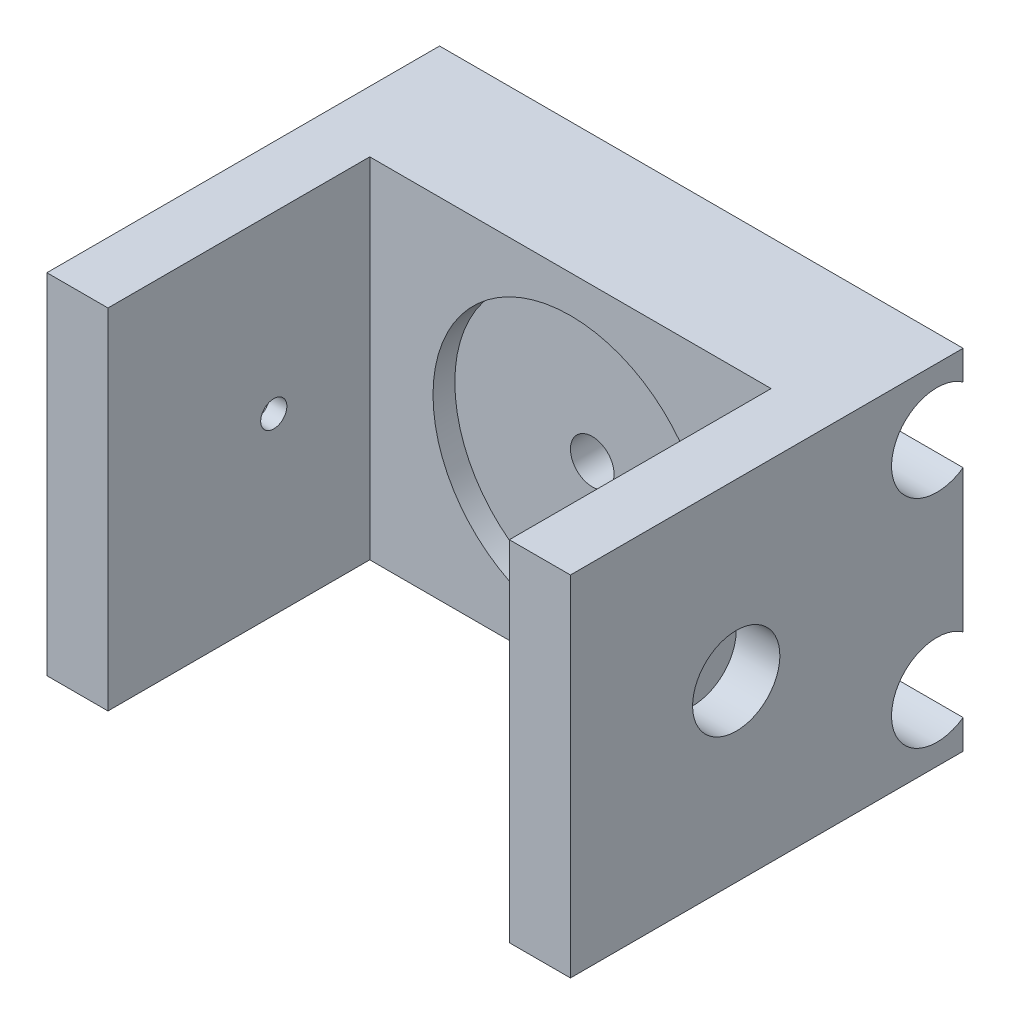
ISO-10303-21;
HEADER;
FILE_DESCRIPTION(('STEP AP214'),'2;1');
FILE_NAME('part.step','',(''),(''),'','','');
FILE_SCHEMA(('AUTOMOTIVE_DESIGN { 1 0 10303 214 1 1 1 1 }'));
ENDSEC;
DATA;
#1=APPLICATION_CONTEXT('core data for automotive mechanical design processes');
#2=APPLICATION_PROTOCOL_DEFINITION('international standard','automotive_design',2000,#1);
#3=PRODUCT_CONTEXT('',#1,'mechanical');
#4=PRODUCT('Part','Part','',(#3));
#5=PRODUCT_RELATED_PRODUCT_CATEGORY('part','',(#4));
#6=PRODUCT_DEFINITION_FORMATION('','',#4);
#7=PRODUCT_DEFINITION_CONTEXT('part definition',#1,'design');
#8=PRODUCT_DEFINITION('design','',#6,#7);
#9=PRODUCT_DEFINITION_SHAPE('','',#8);
#10=(LENGTH_UNIT() NAMED_UNIT(*) SI_UNIT(.MILLI.,.METRE.));
#11=(NAMED_UNIT(*) PLANE_ANGLE_UNIT() SI_UNIT($,.RADIAN.));
#12=(NAMED_UNIT(*) SI_UNIT($,.STERADIAN.) SOLID_ANGLE_UNIT());
#13=UNCERTAINTY_MEASURE_WITH_UNIT(LENGTH_MEASURE(1.E-05),#10,'distance_accuracy_value','');
#14=(GEOMETRIC_REPRESENTATION_CONTEXT(3) GLOBAL_UNCERTAINTY_ASSIGNED_CONTEXT((#13)) GLOBAL_UNIT_ASSIGNED_CONTEXT((#10,
#11,#12)) REPRESENTATION_CONTEXT('',''));
#15=CARTESIAN_POINT('',(0.,0.,0.));
#16=DIRECTION('',(0.,0.,1.));
#17=DIRECTION('',(1.,0.,0.));
#18=AXIS2_PLACEMENT_3D('',#15,#16,#17);
#19=CARTESIAN_POINT('',(12.2222222222222,0.915032679738576,45.));
#20=DIRECTION('',(0.,0.,-1.));
#21=DIRECTION('',(-1.,0.,0.));
#22=AXIS2_PLACEMENT_3D('',#19,#20,#21);
#23=CYLINDRICAL_SURFACE('',#22,2.5);
#24=CARTESIAN_POINT('',(12.2222222222222,0.915032679738576,4.));
#25=DIRECTION('',(0.,0.,-1.));
#26=DIRECTION('',(-1.,0.,0.));
#27=AXIS2_PLACEMENT_3D('',#24,#25,#26);
#28=CIRCLE('',#27,2.5);
#29=CARTESIAN_POINT('',(9.72222222222224,0.915032679738576,4.));
#30=VERTEX_POINT('',#29);
#31=EDGE_CURVE('E242',#30,#30,#28,.T.);
#32=ORIENTED_EDGE('',*,*,#31,.T.);
#33=EDGE_LOOP('',(#32));
#34=FACE_BOUND('',#33,.T.);
#35=CARTESIAN_POINT('',(12.2222222222222,0.915032679738576,12.5));
#36=DIRECTION('',(0.,0.,1.));
#37=DIRECTION('',(1.,0.,0.));
#38=AXIS2_PLACEMENT_3D('',#35,#36,#37);
#39=CIRCLE('',#38,2.5);
#40=CARTESIAN_POINT('',(14.7222222222222,0.915032679738576,12.5));
#41=VERTEX_POINT('',#40);
#42=EDGE_CURVE('E240',#41,#41,#39,.F.);
#43=ORIENTED_EDGE('',*,*,#42,.F.);
#44=EDGE_LOOP('',(#43));
#45=FACE_BOUND('',#44,.T.);
#46=ADVANCED_FACE('F49',(#34,#45),#23,.F.);
#47=CARTESIAN_POINT('',(0.,0.,0.));
#48=DIRECTION('',(0.,0.,1.));
#49=DIRECTION('',(1.,0.,0.));
#50=AXIS2_PLACEMENT_3D('',#47,#48,#49);
#51=PLANE('',#50);
#52=DIRECTION('',(0.,-1.,0.));
#53=VECTOR('',#52,1.);
#54=CARTESIAN_POINT('',(-17.7777777777778,20.9150326797386,0.));
#55=LINE('',#54,#53);
#56=CARTESIAN_POINT('',(-17.7777777777778,-15.7323194365805,0.));
#57=VERTEX_POINT('',#56);
#58=CARTESIAN_POINT('',(-17.7777777777778,-19.0849673202614,0.));
#59=VERTEX_POINT('',#58);
#60=EDGE_CURVE('E147',#57,#59,#55,.T.);
#61=ORIENTED_EDGE('',*,*,#60,.F.);
#62=DIRECTION('',(1.,0.,0.));
#63=VECTOR('',#62,1.);
#64=CARTESIAN_POINT('',(-20.7777777777778,-15.7323194365805,0.));
#65=LINE('',#64,#63);
#66=CARTESIAN_POINT('',(42.2222222222222,-15.7323194365805,0.));
#67=VERTEX_POINT('',#66);
#68=EDGE_CURVE('E11',#57,#67,#65,.T.);
#69=ORIENTED_EDGE('',*,*,#68,.T.);
#70=DIRECTION('',(0.,1.,0.));
#71=VECTOR('',#70,1.);
#72=CARTESIAN_POINT('',(42.2222222222222,20.9150326797386,0.));
#73=LINE('',#72,#71);
#74=CARTESIAN_POINT('',(42.2222222222222,-19.0849673202614,0.));
#75=VERTEX_POINT('',#74);
#76=EDGE_CURVE('E223',#75,#67,#73,.T.);
#77=ORIENTED_EDGE('',*,*,#76,.F.);
#78=DIRECTION('',(1.,0.,0.));
#79=VECTOR('',#78,1.);
#80=CARTESIAN_POINT('',(-17.7777777777778,-19.0849673202614,0.));
#81=LINE('',#80,#79);
#82=EDGE_CURVE('E219',#59,#75,#81,.T.);
#83=ORIENTED_EDGE('',*,*,#82,.F.);
#84=EDGE_LOOP('',(#61,#69,#77,#83));
#85=FACE_BOUND('',#84,.T.);
#86=ADVANCED_FACE('F287',(#85),#51,.F.);
#87=CARTESIAN_POINT('',(12.2222222222222,0.915032679738576,0.));
#88=DIRECTION('',(0.,0.,-1.));
#89=DIRECTION('',(-1.,0.,0.));
#90=AXIS2_PLACEMENT_3D('',#87,#88,#89);
#91=CIRCLE('',#90,5.);
#92=CARTESIAN_POINT('',(7.22222222222224,0.915032679738576,0.));
#93=VERTEX_POINT('',#92);
#94=EDGE_CURVE('E247',#93,#93,#91,.T.);
#95=ORIENTED_EDGE('',*,*,#94,.F.);
#96=EDGE_LOOP('',(#95));
#97=FACE_BOUND('',#96,.T.);
#98=CARTESIAN_POINT('',(42.2222222222222,-7.23761520394236,0.));
#99=VERTEX_POINT('',#98);
#100=CARTESIAN_POINT('',(42.2222222222222,9.06768056341952,0.));
#101=VERTEX_POINT('',#100);
#102=EDGE_CURVE('E226',#99,#101,#73,.T.);
#103=ORIENTED_EDGE('',*,*,#102,.F.);
#104=DIRECTION('',(1.,0.,0.));
#105=VECTOR('',#104,1.);
#106=CARTESIAN_POINT('',(-20.7777777777778,-7.23761520394237,0.));
#107=LINE('',#106,#105);
#108=CARTESIAN_POINT('',(-17.7777777777778,-7.23761520394236,0.));
#109=VERTEX_POINT('',#108);
#110=EDGE_CURVE('E58',#99,#109,#107,.F.);
#111=ORIENTED_EDGE('',*,*,#110,.T.);
#112=CARTESIAN_POINT('',(-17.7777777777778,9.06768056341951,0.));
#113=VERTEX_POINT('',#112);
#114=EDGE_CURVE('E220',#113,#109,#55,.T.);
#115=ORIENTED_EDGE('',*,*,#114,.F.);
#116=DIRECTION('',(1.,0.,0.));
#117=VECTOR('',#116,1.);
#118=CARTESIAN_POINT('',(-20.7777777777778,9.06768056341951,0.));
#119=LINE('',#118,#117);
#120=EDGE_CURVE('E236',#113,#101,#119,.T.);
#121=ORIENTED_EDGE('',*,*,#120,.T.);
#122=EDGE_LOOP('',(#103,#111,#115,#121));
#123=FACE_BOUND('',#122,.T.);
#124=ADVANCED_FACE('F295',(#97,#123),#51,.F.);
#125=CARTESIAN_POINT('',(-17.7777777777778,20.9150326797386,15.));
#126=DIRECTION('',(1.,0.,0.));
#127=DIRECTION('',(0.,0.,-1.));
#128=AXIS2_PLACEMENT_3D('',#125,#126,#127);
#129=PLANE('',#128);
#130=CARTESIAN_POINT('',(-17.7777777777778,0.915032679738565,26.));
#131=DIRECTION('',(1.,0.,0.));
#132=DIRECTION('',(0.,1.,0.));
#133=AXIS2_PLACEMENT_3D('',#130,#131,#132);
#134=CIRCLE('',#133,5.);
#135=CARTESIAN_POINT('',(-17.7777777777778,5.91503267973857,26.));
#136=VERTEX_POINT('',#135);
#137=EDGE_CURVE('E263',#136,#136,#134,.T.);
#138=ORIENTED_EDGE('',*,*,#137,.T.);
#139=EDGE_LOOP('',(#138));
#140=FACE_BOUND('',#139,.T.);
#141=ORIENTED_EDGE('',*,*,#114,.T.);
#142=CARTESIAN_POINT('',(-17.7777777777778,-11.4849673202614,3.));
#143=DIRECTION('',(1.,0.,0.));
#144=DIRECTION('',(0.,0.,-1.));
#145=AXIS2_PLACEMENT_3D('',#142,#143,#144);
#146=CIRCLE('',#145,5.2);
#147=EDGE_CURVE('E209',#109,#57,#146,.T.);
#148=ORIENTED_EDGE('',*,*,#147,.T.);
#149=ORIENTED_EDGE('',*,*,#60,.T.);
#150=DIRECTION('',(0.,0.,-1.));
#151=VECTOR('',#150,1.);
#152=CARTESIAN_POINT('',(-17.7777777777778,-19.0849673202614,15.));
#153=LINE('',#152,#151);
#154=CARTESIAN_POINT('',(-17.7777777777778,-19.0849673202614,45.));
#155=VERTEX_POINT('',#154);
#156=EDGE_CURVE('E139',#155,#59,#153,.T.);
#157=ORIENTED_EDGE('',*,*,#156,.F.);
#158=DIRECTION('',(0.,1.,0.));
#159=VECTOR('',#158,1.);
#160=CARTESIAN_POINT('',(-17.7777777777778,20.9150326797386,45.));
#161=LINE('',#160,#159);
#162=CARTESIAN_POINT('',(-17.7777777777778,20.9150326797386,45.));
#163=VERTEX_POINT('',#162);
#164=EDGE_CURVE('E143',#155,#163,#161,.T.);
#165=ORIENTED_EDGE('',*,*,#164,.T.);
#166=DIRECTION('',(0.,0.,-1.));
#167=VECTOR('',#166,1.);
#168=CARTESIAN_POINT('',(-17.7777777777778,20.9150326797386,15.));
#169=LINE('',#168,#167);
#170=CARTESIAN_POINT('',(-17.7777777777778,20.9150326797386,0.));
#171=VERTEX_POINT('',#170);
#172=EDGE_CURVE('E215',#163,#171,#169,.T.);
#173=ORIENTED_EDGE('',*,*,#172,.T.);
#174=CARTESIAN_POINT('',(-17.7777777777778,17.5623847960576,0.));
#175=VERTEX_POINT('',#174);
#176=EDGE_CURVE('E216',#171,#175,#55,.T.);
#177=ORIENTED_EDGE('',*,*,#176,.T.);
#178=CARTESIAN_POINT('',(-17.7777777777778,13.3150326797386,3.));
#179=DIRECTION('',(1.,0.,0.));
#180=DIRECTION('',(0.,0.,-1.));
#181=AXIS2_PLACEMENT_3D('',#178,#179,#180);
#182=CIRCLE('',#181,5.2);
#183=EDGE_CURVE('E205',#175,#113,#182,.T.);
#184=ORIENTED_EDGE('',*,*,#183,.T.);
#185=EDGE_LOOP('',(#141,#148,#149,#157,#165,#173,#177,#184));
#186=FACE_BOUND('',#185,.T.);
#187=ADVANCED_FACE('F51',(#140,#186),#129,.F.);
#188=CARTESIAN_POINT('',(-17.7777777777778,-19.0849673202614,15.));
#189=DIRECTION('',(0.,1.,0.));
#190=DIRECTION('',(-1.,0.,0.));
#191=AXIS2_PLACEMENT_3D('',#188,#189,#190);
#192=PLANE('',#191);
#193=ORIENTED_EDGE('',*,*,#82,.T.);
#194=DIRECTION('',(0.,0.,-1.));
#195=VECTOR('',#194,1.);
#196=CARTESIAN_POINT('',(42.2222222222222,-19.0849673202614,15.));
#197=LINE('',#196,#195);
#198=CARTESIAN_POINT('',(42.2222222222222,-19.0849673202614,45.));
#199=VERTEX_POINT('',#198);
#200=EDGE_CURVE('E152',#199,#75,#197,.T.);
#201=ORIENTED_EDGE('',*,*,#200,.F.);
#202=DIRECTION('',(1.,0.,0.));
#203=VECTOR('',#202,1.);
#204=CARTESIAN_POINT('',(42.2222222222222,-19.0849673202614,45.));
#205=LINE('',#204,#203);
#206=CARTESIAN_POINT('',(35.2222222222222,-19.0849673202614,45.));
#207=VERTEX_POINT('',#206);
#208=EDGE_CURVE('E191',#207,#199,#205,.T.);
#209=ORIENTED_EDGE('',*,*,#208,.F.);
#210=DIRECTION('',(0.,0.,-1.));
#211=VECTOR('',#210,1.);
#212=CARTESIAN_POINT('',(35.2222222222222,-19.0849673202614,45.));
#213=LINE('',#212,#211);
#214=CARTESIAN_POINT('',(35.2222222222222,-19.0849673202614,15.));
#215=VERTEX_POINT('',#214);
#216=EDGE_CURVE('E194',#207,#215,#213,.T.);
#217=ORIENTED_EDGE('',*,*,#216,.T.);
#218=DIRECTION('',(1.,0.,0.));
#219=VECTOR('',#218,1.);
#220=CARTESIAN_POINT('',(-17.7777777777778,-19.0849673202614,15.));
#221=LINE('',#220,#219);
#222=CARTESIAN_POINT('',(-10.7777777777778,-19.0849673202614,15.));
#223=VERTEX_POINT('',#222);
#224=EDGE_CURVE('E211',#223,#215,#221,.T.);
#225=ORIENTED_EDGE('',*,*,#224,.F.);
#226=DIRECTION('',(0.,0.,-1.));
#227=VECTOR('',#226,1.);
#228=CARTESIAN_POINT('',(-10.7777777777778,-19.0849673202614,45.));
#229=LINE('',#228,#227);
#230=CARTESIAN_POINT('',(-10.7777777777778,-19.0849673202614,45.));
#231=VERTEX_POINT('',#230);
#232=EDGE_CURVE('E165',#231,#223,#229,.T.);
#233=ORIENTED_EDGE('',*,*,#232,.F.);
#234=DIRECTION('',(-1.,0.,0.));
#235=VECTOR('',#234,1.);
#236=CARTESIAN_POINT('',(-17.7777777777778,-19.0849673202614,45.));
#237=LINE('',#236,#235);
#238=EDGE_CURVE('E158',#231,#155,#237,.T.);
#239=ORIENTED_EDGE('',*,*,#238,.T.);
#240=ORIENTED_EDGE('',*,*,#156,.T.);
#241=EDGE_LOOP('',(#193,#201,#209,#217,#225,#233,#239,#240));
#242=FACE_BOUND('',#241,.T.);
#243=ADVANCED_FACE('F163',(#242),#192,.F.);
#244=CARTESIAN_POINT('',(42.2222222222222,20.9150326797386,15.));
#245=DIRECTION('',(-1.,0.,0.));
#246=DIRECTION('',(0.,-1.,0.));
#247=AXIS2_PLACEMENT_3D('',#244,#245,#246);
#248=PLANE('',#247);
#249=CARTESIAN_POINT('',(42.2222222222222,0.915032679738576,26.));
#250=DIRECTION('',(1.,0.,0.));
#251=DIRECTION('',(0.,1.,0.));
#252=AXIS2_PLACEMENT_3D('',#249,#250,#251);
#253=CIRCLE('',#252,5.);
#254=CARTESIAN_POINT('',(42.2222222222222,5.91503267973858,26.));
#255=VERTEX_POINT('',#254);
#256=EDGE_CURVE('E177',#255,#255,#253,.T.);
#257=ORIENTED_EDGE('',*,*,#256,.F.);
#258=EDGE_LOOP('',(#257));
#259=FACE_BOUND('',#258,.T.);
#260=ORIENTED_EDGE('',*,*,#76,.T.);
#261=CARTESIAN_POINT('',(42.2222222222222,-11.4849673202614,3.));
#262=DIRECTION('',(1.,0.,0.));
#263=DIRECTION('',(0.,1.,0.));
#264=AXIS2_PLACEMENT_3D('',#261,#262,#263);
#265=CIRCLE('',#264,5.2);
#266=EDGE_CURVE('E203',#99,#67,#265,.T.);
#267=ORIENTED_EDGE('',*,*,#266,.F.);
#268=ORIENTED_EDGE('',*,*,#102,.T.);
#269=CARTESIAN_POINT('',(42.2222222222222,13.3150326797386,3.));
#270=DIRECTION('',(1.,0.,0.));
#271=DIRECTION('',(0.,1.,0.));
#272=AXIS2_PLACEMENT_3D('',#269,#270,#271);
#273=CIRCLE('',#272,5.2);
#274=CARTESIAN_POINT('',(42.2222222222222,17.5623847960576,0.));
#275=VERTEX_POINT('',#274);
#276=EDGE_CURVE('E202',#275,#101,#273,.T.);
#277=ORIENTED_EDGE('',*,*,#276,.F.);
#278=CARTESIAN_POINT('',(42.2222222222222,20.9150326797386,0.));
#279=VERTEX_POINT('',#278);
#280=EDGE_CURVE('E222',#275,#279,#73,.T.);
#281=ORIENTED_EDGE('',*,*,#280,.T.);
#282=DIRECTION('',(0.,0.,-1.));
#283=VECTOR('',#282,1.);
#284=CARTESIAN_POINT('',(42.2222222222222,20.9150326797386,15.));
#285=LINE('',#284,#283);
#286=CARTESIAN_POINT('',(42.2222222222222,20.9150326797386,45.));
#287=VERTEX_POINT('',#286);
#288=EDGE_CURVE('E229',#287,#279,#285,.T.);
#289=ORIENTED_EDGE('',*,*,#288,.F.);
#290=DIRECTION('',(0.,1.,0.));
#291=VECTOR('',#290,1.);
#292=CARTESIAN_POINT('',(42.2222222222222,20.9150326797386,45.));
#293=LINE('',#292,#291);
#294=EDGE_CURVE('E184',#199,#287,#293,.T.);
#295=ORIENTED_EDGE('',*,*,#294,.F.);
#296=ORIENTED_EDGE('',*,*,#200,.T.);
#297=EDGE_LOOP('',(#260,#267,#268,#277,#281,#289,#295,#296));
#298=FACE_BOUND('',#297,.T.);
#299=ADVANCED_FACE('F324',(#259,#298),#248,.F.);
#300=CARTESIAN_POINT('',(-17.7777777777778,20.9150326797386,15.));
#301=DIRECTION('',(0.,-1.,0.));
#302=DIRECTION('',(0.,0.,-1.));
#303=AXIS2_PLACEMENT_3D('',#300,#301,#302);
#304=PLANE('',#303);
#305=DIRECTION('',(-1.,0.,0.));
#306=VECTOR('',#305,1.);
#307=CARTESIAN_POINT('',(-17.7777777777778,20.9150326797386,0.));
#308=LINE('',#307,#306);
#309=EDGE_CURVE('E213',#279,#171,#308,.T.);
#310=ORIENTED_EDGE('',*,*,#309,.T.);
#311=ORIENTED_EDGE('',*,*,#172,.F.);
#312=DIRECTION('',(1.,0.,0.));
#313=VECTOR('',#312,1.);
#314=CARTESIAN_POINT('',(-17.7777777777778,20.9150326797386,45.));
#315=LINE('',#314,#313);
#316=CARTESIAN_POINT('',(-10.7777777777778,20.9150326797386,45.));
#317=VERTEX_POINT('',#316);
#318=EDGE_CURVE('E161',#163,#317,#315,.T.);
#319=ORIENTED_EDGE('',*,*,#318,.T.);
#320=DIRECTION('',(0.,0.,-1.));
#321=VECTOR('',#320,1.);
#322=CARTESIAN_POINT('',(-10.7777777777778,20.9150326797386,45.));
#323=LINE('',#322,#321);
#324=CARTESIAN_POINT('',(-10.7777777777778,20.9150326797386,15.));
#325=VERTEX_POINT('',#324);
#326=EDGE_CURVE('E172',#317,#325,#323,.T.);
#327=ORIENTED_EDGE('',*,*,#326,.T.);
#328=DIRECTION('',(-1.,0.,0.));
#329=VECTOR('',#328,1.);
#330=CARTESIAN_POINT('',(-17.7777777777778,20.9150326797386,15.));
#331=LINE('',#330,#329);
#332=CARTESIAN_POINT('',(35.2222222222222,20.9150326797386,15.));
#333=VERTEX_POINT('',#332);
#334=EDGE_CURVE('E71',#333,#325,#331,.T.);
#335=ORIENTED_EDGE('',*,*,#334,.F.);
#336=DIRECTION('',(0.,0.,-1.));
#337=VECTOR('',#336,1.);
#338=CARTESIAN_POINT('',(35.2222222222222,20.9150326797386,45.));
#339=LINE('',#338,#337);
#340=CARTESIAN_POINT('',(35.2222222222222,20.9150326797386,45.));
#341=VERTEX_POINT('',#340);
#342=EDGE_CURVE('E199',#341,#333,#339,.T.);
#343=ORIENTED_EDGE('',*,*,#342,.F.);
#344=DIRECTION('',(-1.,0.,0.));
#345=VECTOR('',#344,1.);
#346=CARTESIAN_POINT('',(42.2222222222222,20.9150326797386,45.));
#347=LINE('',#346,#345);
#348=EDGE_CURVE('E187',#287,#341,#347,.T.);
#349=ORIENTED_EDGE('',*,*,#348,.F.);
#350=ORIENTED_EDGE('',*,*,#288,.T.);
#351=EDGE_LOOP('',(#310,#311,#319,#327,#335,#343,#349,#350));
#352=FACE_BOUND('',#351,.T.);
#353=ADVANCED_FACE('F330',(#352),#304,.F.);
#354=CARTESIAN_POINT('',(0.,0.,15.));
#355=DIRECTION('',(0.,0.,1.));
#356=DIRECTION('',(1.,0.,0.));
#357=AXIS2_PLACEMENT_3D('',#354,#355,#356);
#358=PLANE('',#357);
#359=CARTESIAN_POINT('',(12.2222222222222,0.915032679738576,15.));
#360=DIRECTION('',(0.,0.,1.));
#361=DIRECTION('',(1.,0.,0.));
#362=AXIS2_PLACEMENT_3D('',#359,#360,#361);
#363=CIRCLE('',#362,15.75);
#364=CARTESIAN_POINT('',(27.9722222222222,0.915032679738576,15.));
#365=VERTEX_POINT('',#364);
#366=EDGE_CURVE('E250',#365,#365,#363,.T.);
#367=ORIENTED_EDGE('',*,*,#366,.F.);
#368=EDGE_LOOP('',(#367));
#369=FACE_BOUND('',#368,.T.);
#370=DIRECTION('',(0.,-1.,0.));
#371=VECTOR('',#370,1.);
#372=CARTESIAN_POINT('',(-10.7777777777778,20.9150326797386,15.));
#373=LINE('',#372,#371);
#374=EDGE_CURVE('E66',#325,#223,#373,.T.);
#375=ORIENTED_EDGE('',*,*,#374,.T.);
#376=ORIENTED_EDGE('',*,*,#224,.T.);
#377=DIRECTION('',(0.,-1.,0.));
#378=VECTOR('',#377,1.);
#379=CARTESIAN_POINT('',(35.2222222222222,20.9150326797386,15.));
#380=LINE('',#379,#378);
#381=EDGE_CURVE('E181',#333,#215,#380,.T.);
#382=ORIENTED_EDGE('',*,*,#381,.F.);
#383=ORIENTED_EDGE('',*,*,#334,.T.);
#384=EDGE_LOOP('',(#375,#376,#382,#383));
#385=FACE_BOUND('',#384,.T.);
#386=ADVANCED_FACE('F365',(#369,#385),#358,.T.);
#387=ORIENTED_EDGE('',*,*,#280,.F.);
#388=DIRECTION('',(1.,0.,0.));
#389=VECTOR('',#388,1.);
#390=CARTESIAN_POINT('',(-20.7777777777778,17.5623847960576,0.));
#391=LINE('',#390,#389);
#392=EDGE_CURVE('E151',#275,#175,#391,.F.);
#393=ORIENTED_EDGE('',*,*,#392,.T.);
#394=ORIENTED_EDGE('',*,*,#176,.F.);
#395=ORIENTED_EDGE('',*,*,#309,.F.);
#396=EDGE_LOOP('',(#387,#393,#394,#395));
#397=FACE_BOUND('',#396,.T.);
#398=ADVANCED_FACE('F298',(#397),#51,.F.);
#399=CARTESIAN_POINT('',(-20.7777777777778,13.3150326797386,3.));
#400=DIRECTION('',(1.,0.,0.));
#401=DIRECTION('',(0.,1.,0.));
#402=AXIS2_PLACEMENT_3D('',#399,#400,#401);
#403=CYLINDRICAL_SURFACE('',#402,5.2);
#404=ORIENTED_EDGE('',*,*,#183,.F.);
#405=ORIENTED_EDGE('',*,*,#392,.F.);
#406=ORIENTED_EDGE('',*,*,#276,.T.);
#407=ORIENTED_EDGE('',*,*,#120,.F.);
#408=EDGE_LOOP('',(#404,#405,#406,#407));
#409=FACE_BOUND('',#408,.T.);
#410=ADVANCED_FACE('F360',(#409),#403,.F.);
#411=CARTESIAN_POINT('',(-20.7777777777778,-11.4849673202614,3.));
#412=DIRECTION('',(1.,0.,0.));
#413=DIRECTION('',(0.,1.,0.));
#414=AXIS2_PLACEMENT_3D('',#411,#412,#413);
#415=CYLINDRICAL_SURFACE('',#414,5.2);
#416=ORIENTED_EDGE('',*,*,#147,.F.);
#417=ORIENTED_EDGE('',*,*,#110,.F.);
#418=ORIENTED_EDGE('',*,*,#266,.T.);
#419=ORIENTED_EDGE('',*,*,#68,.F.);
#420=EDGE_LOOP('',(#416,#417,#418,#419));
#421=FACE_BOUND('',#420,.T.);
#422=ADVANCED_FACE('F356',(#421),#415,.F.);
#423=CARTESIAN_POINT('',(35.2222222222222,20.9150326797386,45.));
#424=DIRECTION('',(1.,0.,0.));
#425=DIRECTION('',(0.,1.,0.));
#426=AXIS2_PLACEMENT_3D('',#423,#424,#425);
#427=PLANE('',#426);
#428=CARTESIAN_POINT('',(35.2222222222222,0.915032679738574,26.));
#429=DIRECTION('',(1.,0.,0.));
#430=DIRECTION('',(0.,1.,0.));
#431=AXIS2_PLACEMENT_3D('',#428,#429,#430);
#432=CIRCLE('',#431,1.5);
#433=CARTESIAN_POINT('',(35.2222222222222,2.41503267973858,26.));
#434=VERTEX_POINT('',#433);
#435=EDGE_CURVE('E255',#434,#434,#432,.T.);
#436=ORIENTED_EDGE('',*,*,#435,.T.);
#437=EDGE_LOOP('',(#436));
#438=FACE_BOUND('',#437,.T.);
#439=ORIENTED_EDGE('',*,*,#381,.T.);
#440=ORIENTED_EDGE('',*,*,#216,.F.);
#441=DIRECTION('',(0.,-1.,0.));
#442=VECTOR('',#441,1.);
#443=CARTESIAN_POINT('',(35.2222222222222,20.9150326797386,45.));
#444=LINE('',#443,#442);
#445=EDGE_CURVE('E189',#341,#207,#444,.T.);
#446=ORIENTED_EDGE('',*,*,#445,.F.);
#447=ORIENTED_EDGE('',*,*,#342,.T.);
#448=EDGE_LOOP('',(#439,#440,#446,#447));
#449=FACE_BOUND('',#448,.T.);
#450=ADVANCED_FACE('F352',(#438,#449),#427,.F.);
#451=CARTESIAN_POINT('',(0.,0.,45.));
#452=DIRECTION('',(0.,0.,-1.));
#453=DIRECTION('',(-1.,0.,0.));
#454=AXIS2_PLACEMENT_3D('',#451,#452,#453);
#455=PLANE('',#454);
#456=ORIENTED_EDGE('',*,*,#294,.T.);
#457=ORIENTED_EDGE('',*,*,#348,.T.);
#458=ORIENTED_EDGE('',*,*,#445,.T.);
#459=ORIENTED_EDGE('',*,*,#208,.T.);
#460=EDGE_LOOP('',(#456,#457,#458,#459));
#461=FACE_BOUND('',#460,.T.);
#462=ADVANCED_FACE('F348',(#461),#455,.F.);
#463=CARTESIAN_POINT('',(37.2222222222222,0.915032679738575,26.));
#464=DIRECTION('',(1.,0.,0.));
#465=DIRECTION('',(0.,1.,0.));
#466=AXIS2_PLACEMENT_3D('',#463,#464,#465);
#467=CYLINDRICAL_SURFACE('',#466,5.);
#468=CARTESIAN_POINT('',(37.2222222222222,0.915032679738575,26.));
#469=DIRECTION('',(1.,0.,0.));
#470=DIRECTION('',(0.,1.,0.));
#471=AXIS2_PLACEMENT_3D('',#468,#469,#470);
#472=CIRCLE('',#471,5.);
#473=CARTESIAN_POINT('',(37.2222222222222,5.91503267973857,26.));
#474=VERTEX_POINT('',#473);
#475=EDGE_CURVE('E178',#474,#474,#472,.T.);
#476=ORIENTED_EDGE('',*,*,#475,.F.);
#477=EDGE_LOOP('',(#476));
#478=FACE_BOUND('',#477,.T.);
#479=ORIENTED_EDGE('',*,*,#256,.T.);
#480=EDGE_LOOP('',(#479));
#481=FACE_BOUND('',#480,.T.);
#482=ADVANCED_FACE('F341',(#478,#481),#467,.F.);
#483=CARTESIAN_POINT('',(37.2222222222222,0.915032679738575,26.));
#484=DIRECTION('',(1.,0.,0.));
#485=DIRECTION('',(0.,1.,0.));
#486=AXIS2_PLACEMENT_3D('',#483,#484,#485);
#487=PLANE('',#486);
#488=CARTESIAN_POINT('',(37.2222222222222,0.915032679738575,26.));
#489=DIRECTION('',(1.,0.,0.));
#490=DIRECTION('',(0.,1.,0.));
#491=AXIS2_PLACEMENT_3D('',#488,#489,#490);
#492=CIRCLE('',#491,1.5);
#493=CARTESIAN_POINT('',(37.2222222222222,2.41503267973858,26.));
#494=VERTEX_POINT('',#493);
#495=EDGE_CURVE('E534',#494,#494,#492,.T.);
#496=ORIENTED_EDGE('',*,*,#495,.F.);
#497=EDGE_LOOP('',(#496));
#498=FACE_BOUND('',#497,.T.);
#499=ORIENTED_EDGE('',*,*,#475,.T.);
#500=EDGE_LOOP('',(#499));
#501=FACE_BOUND('',#500,.T.);
#502=ADVANCED_FACE('F335',(#498,#501),#487,.T.);
#503=CARTESIAN_POINT('',(-10.7777777777778,20.9150326797386,45.));
#504=DIRECTION('',(1.,0.,0.));
#505=DIRECTION('',(0.,1.,0.));
#506=AXIS2_PLACEMENT_3D('',#503,#504,#505);
#507=PLANE('',#506);
#508=CARTESIAN_POINT('',(-10.7777777777778,0.915032679738567,26.));
#509=DIRECTION('',(1.,0.,0.));
#510=DIRECTION('',(0.,1.,0.));
#511=AXIS2_PLACEMENT_3D('',#508,#509,#510);
#512=CIRCLE('',#511,1.5);
#513=CARTESIAN_POINT('',(-10.7777777777778,2.41503267973857,26.));
#514=VERTEX_POINT('',#513);
#515=EDGE_CURVE('E537',#514,#514,#512,.T.);
#516=ORIENTED_EDGE('',*,*,#515,.F.);
#517=EDGE_LOOP('',(#516));
#518=FACE_BOUND('',#517,.T.);
#519=ORIENTED_EDGE('',*,*,#374,.F.);
#520=ORIENTED_EDGE('',*,*,#326,.F.);
#521=DIRECTION('',(0.,-1.,0.));
#522=VECTOR('',#521,1.);
#523=CARTESIAN_POINT('',(-10.7777777777778,20.9150326797386,45.));
#524=LINE('',#523,#522);
#525=EDGE_CURVE('E166',#317,#231,#524,.T.);
#526=ORIENTED_EDGE('',*,*,#525,.T.);
#527=ORIENTED_EDGE('',*,*,#232,.T.);
#528=EDGE_LOOP('',(#519,#520,#526,#527));
#529=FACE_BOUND('',#528,.T.);
#530=ADVANCED_FACE('F284',(#518,#529),#507,.T.);
#531=CARTESIAN_POINT('',(24.4444444444445,0.,45.));
#532=DIRECTION('',(0.,0.,-1.));
#533=DIRECTION('',(1.,0.,0.));
#534=AXIS2_PLACEMENT_3D('',#531,#532,#533);
#535=PLANE('',#534);
#536=ORIENTED_EDGE('',*,*,#164,.F.);
#537=ORIENTED_EDGE('',*,*,#238,.F.);
#538=ORIENTED_EDGE('',*,*,#525,.F.);
#539=ORIENTED_EDGE('',*,*,#318,.F.);
#540=EDGE_LOOP('',(#536,#537,#538,#539));
#541=FACE_BOUND('',#540,.T.);
#542=ADVANCED_FACE('F156',(#541),#535,.F.);
#543=CARTESIAN_POINT('',(-12.7777777777778,0.915032679738566,26.));
#544=DIRECTION('',(-1.,0.,0.));
#545=DIRECTION('',(0.,-1.,0.));
#546=AXIS2_PLACEMENT_3D('',#543,#544,#545);
#547=CYLINDRICAL_SURFACE('',#546,5.);
#548=CARTESIAN_POINT('',(-12.7777777777778,0.915032679738566,26.));
#549=DIRECTION('',(1.,0.,0.));
#550=DIRECTION('',(0.,1.,0.));
#551=AXIS2_PLACEMENT_3D('',#548,#549,#550);
#552=CIRCLE('',#551,5.);
#553=CARTESIAN_POINT('',(-12.7777777777778,5.91503267973857,26.));
#554=VERTEX_POINT('',#553);
#555=EDGE_CURVE('E174',#554,#554,#552,.T.);
#556=ORIENTED_EDGE('',*,*,#555,.T.);
#557=EDGE_LOOP('',(#556));
#558=FACE_BOUND('',#557,.T.);
#559=ORIENTED_EDGE('',*,*,#137,.F.);
#560=EDGE_LOOP('',(#559));
#561=FACE_BOUND('',#560,.T.);
#562=ADVANCED_FACE('F271',(#558,#561),#547,.F.);
#563=CARTESIAN_POINT('',(-12.7777777777778,0.915032679738566,26.));
#564=DIRECTION('',(-1.,0.,0.));
#565=DIRECTION('',(0.,1.,0.));
#566=AXIS2_PLACEMENT_3D('',#563,#564,#565);
#567=PLANE('',#566);
#568=CARTESIAN_POINT('',(-12.7777777777778,0.915032679738566,26.));
#569=DIRECTION('',(-1.,0.,0.));
#570=DIRECTION('',(0.,-1.,0.));
#571=AXIS2_PLACEMENT_3D('',#568,#569,#570);
#572=CIRCLE('',#571,1.5);
#573=CARTESIAN_POINT('',(-12.7777777777778,-0.584967320261434,26.));
#574=VERTEX_POINT('',#573);
#575=EDGE_CURVE('E53',#574,#574,#572,.T.);
#576=ORIENTED_EDGE('',*,*,#575,.F.);
#577=EDGE_LOOP('',(#576));
#578=FACE_BOUND('',#577,.T.);
#579=ORIENTED_EDGE('',*,*,#555,.F.);
#580=EDGE_LOOP('',(#579));
#581=FACE_BOUND('',#580,.T.);
#582=ADVANCED_FACE('F273',(#578,#581),#567,.T.);
#583=CARTESIAN_POINT('',(12.2222222222222,0.915032679738576,4.));
#584=DIRECTION('',(0.,0.,-1.));
#585=DIRECTION('',(-1.,0.,0.));
#586=AXIS2_PLACEMENT_3D('',#583,#584,#585);
#587=CYLINDRICAL_SURFACE('',#586,5.);
#588=CARTESIAN_POINT('',(12.2222222222222,0.915032679738576,4.));
#589=DIRECTION('',(0.,0.,-1.));
#590=DIRECTION('',(-1.,0.,0.));
#591=AXIS2_PLACEMENT_3D('',#588,#589,#590);
#592=CIRCLE('',#591,5.);
#593=CARTESIAN_POINT('',(7.22222222222224,0.915032679738576,4.));
#594=VERTEX_POINT('',#593);
#595=EDGE_CURVE('E260',#594,#594,#592,.T.);
#596=ORIENTED_EDGE('',*,*,#595,.F.);
#597=EDGE_LOOP('',(#596));
#598=FACE_BOUND('',#597,.T.);
#599=ORIENTED_EDGE('',*,*,#94,.T.);
#600=EDGE_LOOP('',(#599));
#601=FACE_BOUND('',#600,.T.);
#602=ADVANCED_FACE('F281',(#598,#601),#587,.F.);
#603=CARTESIAN_POINT('',(12.2222222222222,0.915032679738576,4.));
#604=DIRECTION('',(0.,0.,-1.));
#605=DIRECTION('',(-1.,0.,0.));
#606=AXIS2_PLACEMENT_3D('',#603,#604,#605);
#607=PLANE('',#606);
#608=ORIENTED_EDGE('',*,*,#31,.F.);
#609=EDGE_LOOP('',(#608));
#610=FACE_BOUND('',#609,.T.);
#611=ORIENTED_EDGE('',*,*,#595,.T.);
#612=EDGE_LOOP('',(#611));
#613=FACE_BOUND('',#612,.T.);
#614=ADVANCED_FACE('F304',(#610,#613),#607,.T.);
#615=CARTESIAN_POINT('',(12.2222222222222,0.915032679738576,12.5));
#616=DIRECTION('',(0.,0.,1.));
#617=DIRECTION('',(1.,0.,0.));
#618=AXIS2_PLACEMENT_3D('',#615,#616,#617);
#619=PLANE('',#618);
#620=CARTESIAN_POINT('',(12.2222222222222,0.915032679738576,12.5));
#621=DIRECTION('',(0.,0.,1.));
#622=DIRECTION('',(1.,0.,0.));
#623=AXIS2_PLACEMENT_3D('',#620,#621,#622);
#624=CIRCLE('',#623,15.75);
#625=CARTESIAN_POINT('',(27.9722222222222,0.915032679738576,12.5));
#626=VERTEX_POINT('',#625);
#627=EDGE_CURVE('E243',#626,#626,#624,.T.);
#628=ORIENTED_EDGE('',*,*,#627,.T.);
#629=EDGE_LOOP('',(#628));
#630=FACE_BOUND('',#629,.T.);
#631=ORIENTED_EDGE('',*,*,#42,.T.);
#632=EDGE_LOOP('',(#631));
#633=FACE_BOUND('',#632,.T.);
#634=ADVANCED_FACE('F306',(#630,#633),#619,.T.);
#635=CARTESIAN_POINT('',(12.2222222222222,0.915032679738576,12.5));
#636=DIRECTION('',(0.,0.,1.));
#637=DIRECTION('',(1.,0.,0.));
#638=AXIS2_PLACEMENT_3D('',#635,#636,#637);
#639=CYLINDRICAL_SURFACE('',#638,15.75);
#640=ORIENTED_EDGE('',*,*,#627,.F.);
#641=EDGE_LOOP('',(#640));
#642=FACE_BOUND('',#641,.T.);
#643=ORIENTED_EDGE('',*,*,#366,.T.);
#644=EDGE_LOOP('',(#643));
#645=FACE_BOUND('',#644,.T.);
#646=ADVANCED_FACE('F302',(#642,#645),#639,.F.);
#647=CARTESIAN_POINT('',(42.2222222222222,0.915032679738576,26.));
#648=DIRECTION('',(-1.,0.,0.));
#649=DIRECTION('',(0.,-1.,0.));
#650=AXIS2_PLACEMENT_3D('',#647,#648,#649);
#651=CYLINDRICAL_SURFACE('',#650,1.5);
#652=ORIENTED_EDGE('',*,*,#515,.T.);
#653=EDGE_LOOP('',(#652));
#654=FACE_BOUND('',#653,.T.);
#655=ORIENTED_EDGE('',*,*,#575,.T.);
#656=EDGE_LOOP('',(#655));
#657=FACE_BOUND('',#656,.T.);
#658=ADVANCED_FACE('F511',(#654,#657),#651,.F.);
#659=ORIENTED_EDGE('',*,*,#495,.T.);
#660=EDGE_LOOP('',(#659));
#661=FACE_BOUND('',#660,.T.);
#662=ORIENTED_EDGE('',*,*,#435,.F.);
#663=EDGE_LOOP('',(#662));
#664=FACE_BOUND('',#663,.T.);
#665=ADVANCED_FACE('F519',(#661,#664),#651,.F.);
#666=CLOSED_SHELL('',(#46,#86,#124,#187,#243,#299,#353,#386,#398,#410,#422,#450,#462,#482,#502,
#530,#542,#562,#582,#602,#614,#634,#646,#658,#665));
#667=MANIFOLD_SOLID_BREP('B2',#666);
#668=ADVANCED_BREP_SHAPE_REPRESENTATION('',(#18,#667),#14);
#669=SHAPE_DEFINITION_REPRESENTATION(#9,#668);
ENDSEC;
END-ISO-10303-21;
